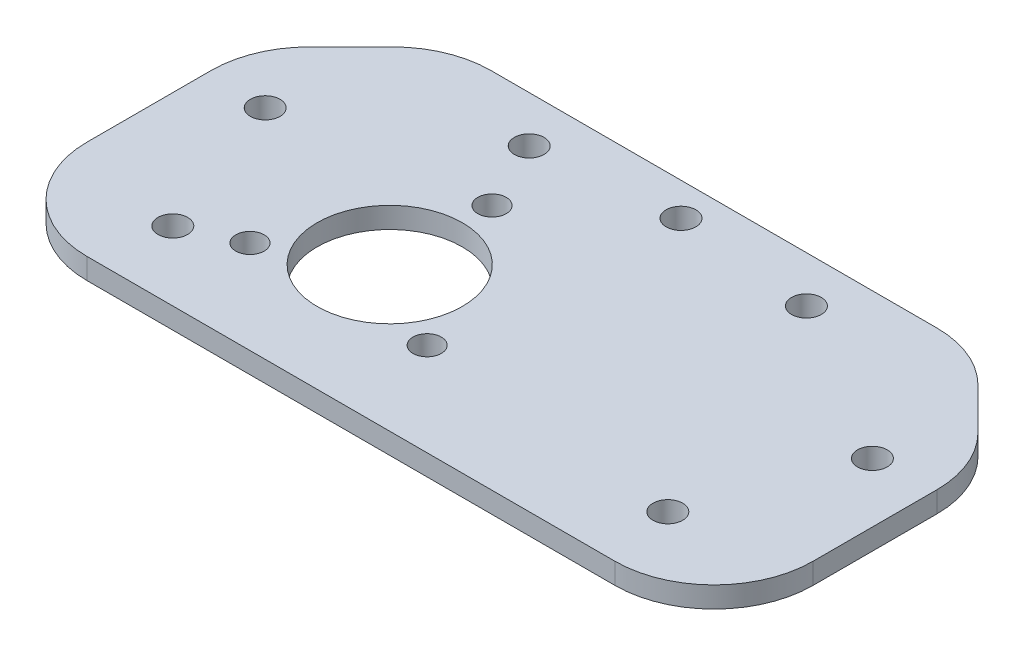
ISO-10303-21;
HEADER;
FILE_DESCRIPTION(('STEP AP214'),'2;1');
FILE_NAME('part.step','',(''),(''),'','','');
FILE_SCHEMA(('AUTOMOTIVE_DESIGN { 1 0 10303 214 1 1 1 1 }'));
ENDSEC;
DATA;
#1=APPLICATION_CONTEXT('core data for automotive mechanical design processes');
#2=APPLICATION_PROTOCOL_DEFINITION('international standard','automotive_design',2000,#1);
#3=PRODUCT_CONTEXT('',#1,'mechanical');
#4=PRODUCT('Part','Part','',(#3));
#5=PRODUCT_RELATED_PRODUCT_CATEGORY('part','',(#4));
#6=PRODUCT_DEFINITION_FORMATION('','',#4);
#7=PRODUCT_DEFINITION_CONTEXT('part definition',#1,'design');
#8=PRODUCT_DEFINITION('design','',#6,#7);
#9=PRODUCT_DEFINITION_SHAPE('','',#8);
#10=(LENGTH_UNIT() NAMED_UNIT(*) SI_UNIT(.MILLI.,.METRE.));
#11=(NAMED_UNIT(*) PLANE_ANGLE_UNIT() SI_UNIT($,.RADIAN.));
#12=(NAMED_UNIT(*) SI_UNIT($,.STERADIAN.) SOLID_ANGLE_UNIT());
#13=UNCERTAINTY_MEASURE_WITH_UNIT(LENGTH_MEASURE(1.E-05),#10,'distance_accuracy_value','');
#14=(GEOMETRIC_REPRESENTATION_CONTEXT(3) GLOBAL_UNCERTAINTY_ASSIGNED_CONTEXT((#13)) GLOBAL_UNIT_ASSIGNED_CONTEXT((#10,
#11,#12)) REPRESENTATION_CONTEXT('',''));
#15=CARTESIAN_POINT('',(0.,0.,0.));
#16=DIRECTION('',(0.,0.,1.));
#17=DIRECTION('',(1.,0.,0.));
#18=AXIS2_PLACEMENT_3D('',#15,#16,#17);
#19=CARTESIAN_POINT('',(0.,-1.5875,0.));
#20=DIRECTION('',(0.,1.,0.));
#21=DIRECTION('',(0.,0.,1.));
#22=AXIS2_PLACEMENT_3D('',#19,#20,#21);
#23=PLANE('',#22);
#24=CARTESIAN_POINT('',(-16.,-1.5875,5.6355287256594));
#25=DIRECTION('',(0.,-1.,0.));
#26=DIRECTION('',(0.,0.,-1.));
#27=AXIS2_PLACEMENT_3D('',#24,#25,#26);
#28=CIRCLE('',#27,11.);
#29=CARTESIAN_POINT('',(-16.,-1.5875,-5.3644712743406));
#30=VERTEX_POINT('',#29);
#31=EDGE_CURVE('E281',#30,#30,#28,.T.);
#32=ORIENTED_EDGE('',*,*,#31,.F.);
#33=EDGE_LOOP('',(#32));
#34=FACE_BOUND('',#33,.T.);
#35=CARTESIAN_POINT('',(-37.5,-1.5875,17.0000000000003));
#36=DIRECTION('',(0.,-1.,0.));
#37=DIRECTION('',(0.,0.,-1.));
#38=AXIS2_PLACEMENT_3D('',#35,#36,#37);
#39=CIRCLE('',#38,2.24999999999999);
#40=CARTESIAN_POINT('',(-37.5,-1.5875,14.7500000000003));
#41=VERTEX_POINT('',#40);
#42=EDGE_CURVE('E277',#41,#41,#39,.T.);
#43=ORIENTED_EDGE('',*,*,#42,.F.);
#44=EDGE_LOOP('',(#43));
#45=FACE_BOUND('',#44,.T.);
#46=CARTESIAN_POINT('',(37.5,-1.5875,17.0000000000003));
#47=DIRECTION('',(0.,-1.,0.));
#48=DIRECTION('',(0.,0.,-1.));
#49=AXIS2_PLACEMENT_3D('',#46,#47,#48);
#50=CIRCLE('',#49,2.24999999999999);
#51=CARTESIAN_POINT('',(37.5,-1.5875,14.7500000000003));
#52=VERTEX_POINT('',#51);
#53=EDGE_CURVE('E271',#52,#52,#50,.T.);
#54=ORIENTED_EDGE('',*,*,#53,.F.);
#55=EDGE_LOOP('',(#54));
#56=FACE_BOUND('',#55,.T.);
#57=CARTESIAN_POINT('',(-46.,-1.5875,-5.50000000000001));
#58=DIRECTION('',(0.,1.,0.));
#59=DIRECTION('',(0.,0.,1.));
#60=AXIS2_PLACEMENT_3D('',#57,#58,#59);
#61=CIRCLE('',#60,2.25);
#62=CARTESIAN_POINT('',(-46.,-1.5875,-3.25000000000001));
#63=VERTEX_POINT('',#62);
#64=EDGE_CURVE('E262',#63,#63,#61,.T.);
#65=ORIENTED_EDGE('',*,*,#64,.T.);
#66=EDGE_LOOP('',(#65));
#67=FACE_BOUND('',#66,.T.);
#68=CARTESIAN_POINT('',(-21.,-1.5875,-20.5));
#69=DIRECTION('',(0.,1.,0.));
#70=DIRECTION('',(0.,0.,1.));
#71=AXIS2_PLACEMENT_3D('',#68,#69,#70);
#72=CIRCLE('',#71,2.25);
#73=CARTESIAN_POINT('',(-21.,-1.5875,-18.25));
#74=VERTEX_POINT('',#73);
#75=EDGE_CURVE('E256',#74,#74,#72,.T.);
#76=ORIENTED_EDGE('',*,*,#75,.T.);
#77=EDGE_LOOP('',(#76));
#78=FACE_BOUND('',#77,.T.);
#79=CARTESIAN_POINT('',(21.,-1.5875,-20.5));
#80=DIRECTION('',(0.,1.,0.));
#81=DIRECTION('',(0.,0.,1.));
#82=AXIS2_PLACEMENT_3D('',#79,#80,#81);
#83=CIRCLE('',#82,2.25);
#84=CARTESIAN_POINT('',(21.,-1.5875,-18.25));
#85=VERTEX_POINT('',#84);
#86=EDGE_CURVE('E250',#85,#85,#83,.T.);
#87=ORIENTED_EDGE('',*,*,#86,.T.);
#88=EDGE_LOOP('',(#87));
#89=FACE_BOUND('',#88,.T.);
#90=CARTESIAN_POINT('',(46.,-1.5875,-5.50000000000001));
#91=DIRECTION('',(0.,1.,0.));
#92=DIRECTION('',(0.,0.,1.));
#93=AXIS2_PLACEMENT_3D('',#90,#91,#92);
#94=CIRCLE('',#93,2.25);
#95=CARTESIAN_POINT('',(46.,-1.5875,-3.25000000000001));
#96=VERTEX_POINT('',#95);
#97=EDGE_CURVE('E244',#96,#96,#94,.T.);
#98=ORIENTED_EDGE('',*,*,#97,.T.);
#99=EDGE_LOOP('',(#98));
#100=FACE_BOUND('',#99,.T.);
#101=CARTESIAN_POINT('',(0.,-1.5875,-22.5));
#102=DIRECTION('',(0.,1.,0.));
#103=DIRECTION('',(0.,0.,1.));
#104=AXIS2_PLACEMENT_3D('',#101,#102,#103);
#105=CIRCLE('',#104,2.25);
#106=CARTESIAN_POINT('',(0.,-1.5875,-20.25));
#107=VERTEX_POINT('',#106);
#108=EDGE_CURVE('E165',#107,#107,#105,.T.);
#109=ORIENTED_EDGE('',*,*,#108,.T.);
#110=EDGE_LOOP('',(#109));
#111=FACE_BOUND('',#110,.T.);
#112=DIRECTION('',(1.,0.,0.));
#113=VECTOR('',#112,1.);
#114=CARTESIAN_POINT('',(55.,-1.5875,27.5));
#115=LINE('',#114,#113);
#116=CARTESIAN_POINT('',(-40.,-1.5875,27.5));
#117=VERTEX_POINT('',#116);
#118=CARTESIAN_POINT('',(40.,-1.5875,27.5));
#119=VERTEX_POINT('',#118);
#120=EDGE_CURVE('E150',#117,#119,#115,.T.);
#121=ORIENTED_EDGE('',*,*,#120,.F.);
#122=CARTESIAN_POINT('',(-40.,-1.5875,12.5));
#123=DIRECTION('',(0.,1.,0.));
#124=DIRECTION('',(0.,0.,1.));
#125=AXIS2_PLACEMENT_3D('',#122,#123,#124);
#126=CIRCLE('',#125,15.);
#127=CARTESIAN_POINT('',(-55.,-1.5875,12.5));
#128=VERTEX_POINT('',#127);
#129=EDGE_CURVE('E133',#117,#128,#126,.F.);
#130=ORIENTED_EDGE('',*,*,#129,.T.);
#131=DIRECTION('',(0.,0.,1.));
#132=VECTOR('',#131,1.);
#133=CARTESIAN_POINT('',(-55.,-1.5875,27.5));
#134=LINE('',#133,#132);
#135=CARTESIAN_POINT('',(-55.,-1.5875,-6.28679656440358));
#136=VERTEX_POINT('',#135);
#137=EDGE_CURVE('E160',#136,#128,#134,.T.);
#138=ORIENTED_EDGE('',*,*,#137,.F.);
#139=CARTESIAN_POINT('',(-40.,-1.5875,-6.28679656440358));
#140=DIRECTION('',(0.,1.,0.));
#141=DIRECTION('',(0.,0.,1.));
#142=AXIS2_PLACEMENT_3D('',#139,#140,#141);
#143=CIRCLE('',#142,15.);
#144=CARTESIAN_POINT('',(-50.6066017177982,-1.5875,-16.8933982822018));
#145=VERTEX_POINT('',#144);
#146=EDGE_CURVE('E144',#136,#145,#143,.F.);
#147=ORIENTED_EDGE('',*,*,#146,.T.);
#148=DIRECTION('',(-0.707106781186549,0.,0.707106781186546));
#149=VECTOR('',#148,1.);
#150=CARTESIAN_POINT('',(-55.,-1.5875,-12.5));
#151=LINE('',#150,#149);
#152=CARTESIAN_POINT('',(-44.3933982822018,-1.5875,-23.1066017177982));
#153=VERTEX_POINT('',#152);
#154=EDGE_CURVE('E175',#145,#153,#151,.F.);
#155=ORIENTED_EDGE('',*,*,#154,.T.);
#156=CARTESIAN_POINT('',(-33.7867965644036,-1.5875,-12.5));
#157=DIRECTION('',(0.,1.,0.));
#158=DIRECTION('',(0.,0.,1.));
#159=AXIS2_PLACEMENT_3D('',#156,#157,#158);
#160=CIRCLE('',#159,15.);
#161=CARTESIAN_POINT('',(-33.7867965644036,-1.5875,-27.5));
#162=VERTEX_POINT('',#161);
#163=EDGE_CURVE('E190',#153,#162,#160,.F.);
#164=ORIENTED_EDGE('',*,*,#163,.T.);
#165=DIRECTION('',(-1.,0.,0.));
#166=VECTOR('',#165,1.);
#167=CARTESIAN_POINT('',(55.,-1.5875,-27.5));
#168=LINE('',#167,#166);
#169=CARTESIAN_POINT('',(33.7867965644036,-1.5875,-27.5));
#170=VERTEX_POINT('',#169);
#171=EDGE_CURVE('E163',#170,#162,#168,.T.);
#172=ORIENTED_EDGE('',*,*,#171,.F.);
#173=CARTESIAN_POINT('',(33.7867965644036,-1.5875,-12.5));
#174=DIRECTION('',(0.,1.,0.));
#175=DIRECTION('',(0.,0.,1.));
#176=AXIS2_PLACEMENT_3D('',#173,#174,#175);
#177=CIRCLE('',#176,15.);
#178=CARTESIAN_POINT('',(44.3933982822018,-1.5875,-23.1066017177982));
#179=VERTEX_POINT('',#178);
#180=EDGE_CURVE('E188',#170,#179,#177,.F.);
#181=ORIENTED_EDGE('',*,*,#180,.T.);
#182=DIRECTION('',(-0.707106781186546,0.,-0.707106781186549));
#183=VECTOR('',#182,1.);
#184=CARTESIAN_POINT('',(40.,-1.5875,-27.5));
#185=LINE('',#184,#183);
#186=CARTESIAN_POINT('',(50.6066017177982,-1.5875,-16.8933982822017));
#187=VERTEX_POINT('',#186);
#188=EDGE_CURVE('E172',#179,#187,#185,.F.);
#189=ORIENTED_EDGE('',*,*,#188,.T.);
#190=CARTESIAN_POINT('',(40.,-1.5875,-6.28679656440354));
#191=DIRECTION('',(0.,1.,0.));
#192=DIRECTION('',(0.,0.,1.));
#193=AXIS2_PLACEMENT_3D('',#190,#191,#192);
#194=CIRCLE('',#193,15.);
#195=CARTESIAN_POINT('',(55.,-1.5875,-6.28679656440354));
#196=VERTEX_POINT('',#195);
#197=EDGE_CURVE('E186',#187,#196,#194,.F.);
#198=ORIENTED_EDGE('',*,*,#197,.T.);
#199=DIRECTION('',(0.,0.,-1.));
#200=VECTOR('',#199,1.);
#201=CARTESIAN_POINT('',(55.,-1.5875,27.5));
#202=LINE('',#201,#200);
#203=CARTESIAN_POINT('',(55.,-1.5875,12.5));
#204=VERTEX_POINT('',#203);
#205=EDGE_CURVE('E159',#204,#196,#202,.T.);
#206=ORIENTED_EDGE('',*,*,#205,.F.);
#207=CARTESIAN_POINT('',(40.,-1.5875,12.5));
#208=DIRECTION('',(0.,1.,0.));
#209=DIRECTION('',(0.,0.,1.));
#210=AXIS2_PLACEMENT_3D('',#207,#208,#209);
#211=CIRCLE('',#210,15.);
#212=EDGE_CURVE('E154',#204,#119,#211,.F.);
#213=ORIENTED_EDGE('',*,*,#212,.T.);
#214=EDGE_LOOP('',(#121,#130,#138,#147,#155,#164,#172,#181,#189,#198,#206,#213));
#215=FACE_BOUND('',#214,.T.);
#216=CARTESIAN_POINT('',(-29.4233937586589,-1.5875,13.3855287256599));
#217=DIRECTION('',(0.,-1.,0.));
#218=DIRECTION('',(0.,0.,-1.));
#219=AXIS2_PLACEMENT_3D('',#216,#217,#218);
#220=CIRCLE('',#219,2.15);
#221=CARTESIAN_POINT('',(-29.4233937586589,-1.5875,11.2355287256599));
#222=VERTEX_POINT('',#221);
#223=EDGE_CURVE('E289',#222,#222,#220,.T.);
#224=ORIENTED_EDGE('',*,*,#223,.F.);
#225=EDGE_LOOP('',(#224));
#226=FACE_BOUND('',#225,.T.);
#227=CARTESIAN_POINT('',(-2.57660624134124,-1.5875,13.3855287256599));
#228=DIRECTION('',(0.,-1.,0.));
#229=DIRECTION('',(0.,0.,-1.));
#230=AXIS2_PLACEMENT_3D('',#227,#228,#229);
#231=CIRCLE('',#230,2.15);
#232=CARTESIAN_POINT('',(-2.57660624134124,-1.5875,11.2355287256599));
#233=VERTEX_POINT('',#232);
#234=EDGE_CURVE('E295',#233,#233,#231,.T.);
#235=ORIENTED_EDGE('',*,*,#234,.F.);
#236=EDGE_LOOP('',(#235));
#237=FACE_BOUND('',#236,.T.);
#238=CARTESIAN_POINT('',(-16.0000000000001,-1.5875,-9.8644712743401));
#239=DIRECTION('',(0.,-1.,0.));
#240=DIRECTION('',(0.,0.,-1.));
#241=AXIS2_PLACEMENT_3D('',#238,#239,#240);
#242=CIRCLE('',#241,2.15);
#243=CARTESIAN_POINT('',(-16.0000000000001,-1.5875,-12.0144712743401));
#244=VERTEX_POINT('',#243);
#245=EDGE_CURVE('E301',#244,#244,#242,.T.);
#246=ORIENTED_EDGE('',*,*,#245,.F.);
#247=EDGE_LOOP('',(#246));
#248=FACE_BOUND('',#247,.T.);
#249=ADVANCED_FACE('F43',(#34,#45,#56,#67,#78,#89,#100,#111,#215,#226,#237,#248),#23,.F.);
#250=CARTESIAN_POINT('',(-55.,1.5875,27.5));
#251=DIRECTION('',(1.,0.,0.));
#252=DIRECTION('',(0.,0.,-1.));
#253=AXIS2_PLACEMENT_3D('',#250,#251,#252);
#254=PLANE('',#253);
#255=ORIENTED_EDGE('',*,*,#137,.T.);
#256=DIRECTION('',(0.,-1.,0.));
#257=VECTOR('',#256,1.);
#258=CARTESIAN_POINT('',(-55.,1.5875,12.5));
#259=LINE('',#258,#257);
#260=CARTESIAN_POINT('',(-55.,1.5875,12.5));
#261=VERTEX_POINT('',#260);
#262=EDGE_CURVE('E138',#128,#261,#259,.F.);
#263=ORIENTED_EDGE('',*,*,#262,.T.);
#264=DIRECTION('',(0.,0.,1.));
#265=VECTOR('',#264,1.);
#266=CARTESIAN_POINT('',(-55.,1.5875,27.5));
#267=LINE('',#266,#265);
#268=CARTESIAN_POINT('',(-55.,1.5875,-6.28679656440358));
#269=VERTEX_POINT('',#268);
#270=EDGE_CURVE('E171',#269,#261,#267,.T.);
#271=ORIENTED_EDGE('',*,*,#270,.F.);
#272=DIRECTION('',(0.,1.,0.));
#273=VECTOR('',#272,1.);
#274=CARTESIAN_POINT('',(-55.,-1.5875,-6.28679656440358));
#275=LINE('',#274,#273);
#276=EDGE_CURVE('E143',#269,#136,#275,.F.);
#277=ORIENTED_EDGE('',*,*,#276,.T.);
#278=EDGE_LOOP('',(#255,#263,#271,#277));
#279=FACE_BOUND('',#278,.T.);
#280=ADVANCED_FACE('F309',(#279),#254,.F.);
#281=CARTESIAN_POINT('',(55.,1.5875,27.5));
#282=DIRECTION('',(0.,0.,-1.));
#283=DIRECTION('',(-1.,0.,0.));
#284=AXIS2_PLACEMENT_3D('',#281,#282,#283);
#285=PLANE('',#284);
#286=DIRECTION('',(1.,0.,0.));
#287=VECTOR('',#286,1.);
#288=CARTESIAN_POINT('',(55.,1.5875,27.5));
#289=LINE('',#288,#287);
#290=CARTESIAN_POINT('',(-40.,1.5875,27.5));
#291=VERTEX_POINT('',#290);
#292=CARTESIAN_POINT('',(40.,1.5875,27.5));
#293=VERTEX_POINT('',#292);
#294=EDGE_CURVE('E153',#291,#293,#289,.T.);
#295=ORIENTED_EDGE('',*,*,#294,.F.);
#296=DIRECTION('',(0.,-1.,0.));
#297=VECTOR('',#296,1.);
#298=CARTESIAN_POINT('',(-40.,1.5875,27.5));
#299=LINE('',#298,#297);
#300=EDGE_CURVE('E137',#291,#117,#299,.T.);
#301=ORIENTED_EDGE('',*,*,#300,.T.);
#302=ORIENTED_EDGE('',*,*,#120,.T.);
#303=DIRECTION('',(0.,-1.,0.));
#304=VECTOR('',#303,1.);
#305=CARTESIAN_POINT('',(40.,1.5875,27.5));
#306=LINE('',#305,#304);
#307=EDGE_CURVE('E155',#119,#293,#306,.F.);
#308=ORIENTED_EDGE('',*,*,#307,.T.);
#309=EDGE_LOOP('',(#295,#301,#302,#308));
#310=FACE_BOUND('',#309,.T.);
#311=ADVANCED_FACE('F149',(#310),#285,.F.);
#312=CARTESIAN_POINT('',(55.,1.5875,27.5));
#313=DIRECTION('',(-1.,0.,0.));
#314=DIRECTION('',(0.,0.,1.));
#315=AXIS2_PLACEMENT_3D('',#312,#313,#314);
#316=PLANE('',#315);
#317=ORIENTED_EDGE('',*,*,#205,.T.);
#318=DIRECTION('',(0.,-1.,0.));
#319=VECTOR('',#318,1.);
#320=CARTESIAN_POINT('',(55.,1.5875,-6.28679656440354));
#321=LINE('',#320,#319);
#322=CARTESIAN_POINT('',(55.,1.5875,-6.28679656440354));
#323=VERTEX_POINT('',#322);
#324=EDGE_CURVE('E11',#196,#323,#321,.F.);
#325=ORIENTED_EDGE('',*,*,#324,.T.);
#326=DIRECTION('',(0.,0.,-1.));
#327=VECTOR('',#326,1.);
#328=CARTESIAN_POINT('',(55.,1.5875,27.5));
#329=LINE('',#328,#327);
#330=CARTESIAN_POINT('',(55.,1.5875,12.5));
#331=VERTEX_POINT('',#330);
#332=EDGE_CURVE('E225',#331,#323,#329,.T.);
#333=ORIENTED_EDGE('',*,*,#332,.F.);
#334=DIRECTION('',(0.,-1.,0.));
#335=VECTOR('',#334,1.);
#336=CARTESIAN_POINT('',(55.,1.5875,12.5));
#337=LINE('',#336,#335);
#338=EDGE_CURVE('E51',#331,#204,#337,.T.);
#339=ORIENTED_EDGE('',*,*,#338,.T.);
#340=EDGE_LOOP('',(#317,#325,#333,#339));
#341=FACE_BOUND('',#340,.T.);
#342=ADVANCED_FACE('F223',(#341),#316,.F.);
#343=CARTESIAN_POINT('',(55.,1.5875,-27.5));
#344=DIRECTION('',(0.,0.,1.));
#345=DIRECTION('',(1.,0.,0.));
#346=AXIS2_PLACEMENT_3D('',#343,#344,#345);
#347=PLANE('',#346);
#348=ORIENTED_EDGE('',*,*,#171,.T.);
#349=DIRECTION('',(0.,-1.,0.));
#350=VECTOR('',#349,1.);
#351=CARTESIAN_POINT('',(-33.7867965644036,1.5875,-27.5));
#352=LINE('',#351,#350);
#353=CARTESIAN_POINT('',(-33.7867965644036,1.5875,-27.5));
#354=VERTEX_POINT('',#353);
#355=EDGE_CURVE('E214',#162,#354,#352,.F.);
#356=ORIENTED_EDGE('',*,*,#355,.T.);
#357=DIRECTION('',(-1.,0.,0.));
#358=VECTOR('',#357,1.);
#359=CARTESIAN_POINT('',(55.,1.5875,-27.5));
#360=LINE('',#359,#358);
#361=CARTESIAN_POINT('',(33.7867965644036,1.5875,-27.5));
#362=VERTEX_POINT('',#361);
#363=EDGE_CURVE('E176',#362,#354,#360,.T.);
#364=ORIENTED_EDGE('',*,*,#363,.F.);
#365=DIRECTION('',(0.,1.,0.));
#366=VECTOR('',#365,1.);
#367=CARTESIAN_POINT('',(33.7867965644036,-1.5875,-27.5));
#368=LINE('',#367,#366);
#369=EDGE_CURVE('E211',#362,#170,#368,.F.);
#370=ORIENTED_EDGE('',*,*,#369,.T.);
#371=EDGE_LOOP('',(#348,#356,#364,#370));
#372=FACE_BOUND('',#371,.T.);
#373=ADVANCED_FACE('F324',(#372),#347,.F.);
#374=CARTESIAN_POINT('',(0.,1.5875,0.));
#375=DIRECTION('',(0.,1.,0.));
#376=DIRECTION('',(0.,0.,1.));
#377=AXIS2_PLACEMENT_3D('',#374,#375,#376);
#378=PLANE('',#377);
#379=CARTESIAN_POINT('',(-16.0000000000001,1.5875,-9.8644712743401));
#380=DIRECTION('',(0.,1.,0.));
#381=DIRECTION('',(0.,0.,1.));
#382=AXIS2_PLACEMENT_3D('',#379,#380,#381);
#383=CIRCLE('',#382,2.15);
#384=CARTESIAN_POINT('',(-16.0000000000001,1.5875,-7.7144712743401));
#385=VERTEX_POINT('',#384);
#386=EDGE_CURVE('E298',#385,#385,#383,.T.);
#387=ORIENTED_EDGE('',*,*,#386,.F.);
#388=EDGE_LOOP('',(#387));
#389=FACE_BOUND('',#388,.T.);
#390=CARTESIAN_POINT('',(-2.57660624134124,1.5875,13.3855287256599));
#391=DIRECTION('',(0.,1.,0.));
#392=DIRECTION('',(0.,0.,1.));
#393=AXIS2_PLACEMENT_3D('',#390,#391,#392);
#394=CIRCLE('',#393,2.15);
#395=CARTESIAN_POINT('',(-2.57660624134124,1.5875,15.5355287256599));
#396=VERTEX_POINT('',#395);
#397=EDGE_CURVE('E292',#396,#396,#394,.T.);
#398=ORIENTED_EDGE('',*,*,#397,.F.);
#399=EDGE_LOOP('',(#398));
#400=FACE_BOUND('',#399,.T.);
#401=CARTESIAN_POINT('',(-29.4233937586589,1.5875,13.3855287256599));
#402=DIRECTION('',(0.,1.,0.));
#403=DIRECTION('',(0.,0.,1.));
#404=AXIS2_PLACEMENT_3D('',#401,#402,#403);
#405=CIRCLE('',#404,2.15);
#406=CARTESIAN_POINT('',(-29.4233937586589,1.5875,15.5355287256599));
#407=VERTEX_POINT('',#406);
#408=EDGE_CURVE('E284',#407,#407,#405,.T.);
#409=ORIENTED_EDGE('',*,*,#408,.F.);
#410=EDGE_LOOP('',(#409));
#411=FACE_BOUND('',#410,.T.);
#412=CARTESIAN_POINT('',(-16.,1.5875,5.6355287256594));
#413=DIRECTION('',(0.,-1.,0.));
#414=DIRECTION('',(0.,0.,-1.));
#415=AXIS2_PLACEMENT_3D('',#412,#413,#414);
#416=CIRCLE('',#415,11.);
#417=CARTESIAN_POINT('',(-16.,1.5875,-5.3644712743406));
#418=VERTEX_POINT('',#417);
#419=EDGE_CURVE('E280',#418,#418,#416,.T.);
#420=ORIENTED_EDGE('',*,*,#419,.T.);
#421=EDGE_LOOP('',(#420));
#422=FACE_BOUND('',#421,.T.);
#423=CARTESIAN_POINT('',(-37.5,1.5875,17.0000000000003));
#424=DIRECTION('',(0.,-1.,0.));
#425=DIRECTION('',(0.,0.,-1.));
#426=AXIS2_PLACEMENT_3D('',#423,#424,#425);
#427=CIRCLE('',#426,2.25);
#428=CARTESIAN_POINT('',(-37.5,1.5875,14.7500000000003));
#429=VERTEX_POINT('',#428);
#430=EDGE_CURVE('E274',#429,#429,#427,.T.);
#431=ORIENTED_EDGE('',*,*,#430,.T.);
#432=EDGE_LOOP('',(#431));
#433=FACE_BOUND('',#432,.T.);
#434=CARTESIAN_POINT('',(37.5,1.5875,17.0000000000003));
#435=DIRECTION('',(0.,-1.,0.));
#436=DIRECTION('',(0.,0.,-1.));
#437=AXIS2_PLACEMENT_3D('',#434,#435,#436);
#438=CIRCLE('',#437,2.25);
#439=CARTESIAN_POINT('',(37.5,1.5875,14.7500000000003));
#440=VERTEX_POINT('',#439);
#441=EDGE_CURVE('E268',#440,#440,#438,.T.);
#442=ORIENTED_EDGE('',*,*,#441,.T.);
#443=EDGE_LOOP('',(#442));
#444=FACE_BOUND('',#443,.T.);
#445=CARTESIAN_POINT('',(-46.,1.5875,-5.50000000000001));
#446=DIRECTION('',(0.,1.,0.));
#447=DIRECTION('',(0.,0.,1.));
#448=AXIS2_PLACEMENT_3D('',#445,#446,#447);
#449=CIRCLE('',#448,2.24999999999999);
#450=CARTESIAN_POINT('',(-46.,1.5875,-3.25000000000002));
#451=VERTEX_POINT('',#450);
#452=EDGE_CURVE('E265',#451,#451,#449,.T.);
#453=ORIENTED_EDGE('',*,*,#452,.F.);
#454=EDGE_LOOP('',(#453));
#455=FACE_BOUND('',#454,.T.);
#456=CARTESIAN_POINT('',(-21.,1.5875,-20.5));
#457=DIRECTION('',(0.,1.,0.));
#458=DIRECTION('',(0.,0.,1.));
#459=AXIS2_PLACEMENT_3D('',#456,#457,#458);
#460=CIRCLE('',#459,2.24999999999999);
#461=CARTESIAN_POINT('',(-21.,1.5875,-18.25));
#462=VERTEX_POINT('',#461);
#463=EDGE_CURVE('E259',#462,#462,#460,.T.);
#464=ORIENTED_EDGE('',*,*,#463,.F.);
#465=EDGE_LOOP('',(#464));
#466=FACE_BOUND('',#465,.T.);
#467=CARTESIAN_POINT('',(21.,1.5875,-20.5));
#468=DIRECTION('',(0.,1.,0.));
#469=DIRECTION('',(0.,0.,1.));
#470=AXIS2_PLACEMENT_3D('',#467,#468,#469);
#471=CIRCLE('',#470,2.24999999999999);
#472=CARTESIAN_POINT('',(21.,1.5875,-18.25));
#473=VERTEX_POINT('',#472);
#474=EDGE_CURVE('E253',#473,#473,#471,.T.);
#475=ORIENTED_EDGE('',*,*,#474,.F.);
#476=EDGE_LOOP('',(#475));
#477=FACE_BOUND('',#476,.T.);
#478=CARTESIAN_POINT('',(46.,1.5875,-5.50000000000001));
#479=DIRECTION('',(0.,1.,0.));
#480=DIRECTION('',(0.,0.,1.));
#481=AXIS2_PLACEMENT_3D('',#478,#479,#480);
#482=CIRCLE('',#481,2.24999999999999);
#483=CARTESIAN_POINT('',(46.,1.5875,-3.25000000000002));
#484=VERTEX_POINT('',#483);
#485=EDGE_CURVE('E247',#484,#484,#482,.T.);
#486=ORIENTED_EDGE('',*,*,#485,.F.);
#487=EDGE_LOOP('',(#486));
#488=FACE_BOUND('',#487,.T.);
#489=CARTESIAN_POINT('',(0.,1.5875,-22.5));
#490=DIRECTION('',(0.,1.,0.));
#491=DIRECTION('',(0.,0.,1.));
#492=AXIS2_PLACEMENT_3D('',#489,#490,#491);
#493=CIRCLE('',#492,2.24999999999999);
#494=CARTESIAN_POINT('',(0.,1.5875,-20.25));
#495=VERTEX_POINT('',#494);
#496=EDGE_CURVE('E241',#495,#495,#493,.T.);
#497=ORIENTED_EDGE('',*,*,#496,.F.);
#498=EDGE_LOOP('',(#497));
#499=FACE_BOUND('',#498,.T.);
#500=ORIENTED_EDGE('',*,*,#270,.T.);
#501=CARTESIAN_POINT('',(-40.,1.5875,12.5));
#502=DIRECTION('',(0.,1.,0.));
#503=DIRECTION('',(0.,0.,1.));
#504=AXIS2_PLACEMENT_3D('',#501,#502,#503);
#505=CIRCLE('',#504,15.);
#506=EDGE_CURVE('E205',#261,#291,#505,.T.);
#507=ORIENTED_EDGE('',*,*,#506,.T.);
#508=ORIENTED_EDGE('',*,*,#294,.T.);
#509=CARTESIAN_POINT('',(40.,1.5875,12.5));
#510=DIRECTION('',(0.,1.,0.));
#511=DIRECTION('',(0.,0.,1.));
#512=AXIS2_PLACEMENT_3D('',#509,#510,#511);
#513=CIRCLE('',#512,15.);
#514=EDGE_CURVE('E196',#293,#331,#513,.T.);
#515=ORIENTED_EDGE('',*,*,#514,.T.);
#516=ORIENTED_EDGE('',*,*,#332,.T.);
#517=CARTESIAN_POINT('',(40.,1.5875,-6.28679656440354));
#518=DIRECTION('',(0.,1.,0.));
#519=DIRECTION('',(0.,0.,1.));
#520=AXIS2_PLACEMENT_3D('',#517,#518,#519);
#521=CIRCLE('',#520,15.);
#522=CARTESIAN_POINT('',(50.6066017177982,1.5875,-16.8933982822017));
#523=VERTEX_POINT('',#522);
#524=EDGE_CURVE('E65',#323,#523,#521,.T.);
#525=ORIENTED_EDGE('',*,*,#524,.T.);
#526=DIRECTION('',(0.707106781186546,0.,0.707106781186549));
#527=VECTOR('',#526,1.);
#528=CARTESIAN_POINT('',(33.7500000000001,1.5875,-33.7499999999999));
#529=LINE('',#528,#527);
#530=CARTESIAN_POINT('',(44.3933982822018,1.5875,-23.1066017177982));
#531=VERTEX_POINT('',#530);
#532=EDGE_CURVE('E179',#523,#531,#529,.F.);
#533=ORIENTED_EDGE('',*,*,#532,.T.);
#534=CARTESIAN_POINT('',(33.7867965644036,1.5875,-12.5));
#535=DIRECTION('',(0.,1.,0.));
#536=DIRECTION('',(0.,0.,1.));
#537=AXIS2_PLACEMENT_3D('',#534,#535,#536);
#538=CIRCLE('',#537,15.);
#539=EDGE_CURVE('E199',#531,#362,#538,.T.);
#540=ORIENTED_EDGE('',*,*,#539,.T.);
#541=ORIENTED_EDGE('',*,*,#363,.T.);
#542=CARTESIAN_POINT('',(-33.7867965644036,1.5875,-12.5));
#543=DIRECTION('',(0.,1.,0.));
#544=DIRECTION('',(0.,0.,1.));
#545=AXIS2_PLACEMENT_3D('',#542,#543,#544);
#546=CIRCLE('',#545,15.);
#547=CARTESIAN_POINT('',(-44.3933982822018,1.5875,-23.1066017177982));
#548=VERTEX_POINT('',#547);
#549=EDGE_CURVE('E201',#354,#548,#546,.T.);
#550=ORIENTED_EDGE('',*,*,#549,.T.);
#551=DIRECTION('',(0.707106781186549,0.,-0.707106781186546));
#552=VECTOR('',#551,1.);
#553=CARTESIAN_POINT('',(-33.7499999999999,1.5875,-33.75));
#554=LINE('',#553,#552);
#555=CARTESIAN_POINT('',(-50.6066017177982,1.5875,-16.8933982822018));
#556=VERTEX_POINT('',#555);
#557=EDGE_CURVE('E181',#548,#556,#554,.F.);
#558=ORIENTED_EDGE('',*,*,#557,.T.);
#559=CARTESIAN_POINT('',(-40.,1.5875,-6.28679656440358));
#560=DIRECTION('',(0.,1.,0.));
#561=DIRECTION('',(0.,0.,1.));
#562=AXIS2_PLACEMENT_3D('',#559,#560,#561);
#563=CIRCLE('',#562,15.);
#564=EDGE_CURVE('E203',#556,#269,#563,.T.);
#565=ORIENTED_EDGE('',*,*,#564,.T.);
#566=EDGE_LOOP('',(#500,#507,#508,#515,#516,#525,#533,#540,#541,#550,#558,#565));
#567=FACE_BOUND('',#566,.T.);
#568=ADVANCED_FACE('F233',(#389,#400,#411,#422,#433,#444,#455,#466,#477,#488,#499,#567),#378,.T.);
#569=CARTESIAN_POINT('',(0.,1.5875,-22.5));
#570=DIRECTION('',(0.,1.,0.));
#571=DIRECTION('',(0.,0.,1.));
#572=AXIS2_PLACEMENT_3D('',#569,#570,#571);
#573=CYLINDRICAL_SURFACE('',#572,2.24999999999999);
#574=ORIENTED_EDGE('',*,*,#108,.F.);
#575=EDGE_LOOP('',(#574));
#576=FACE_BOUND('',#575,.T.);
#577=ORIENTED_EDGE('',*,*,#496,.T.);
#578=EDGE_LOOP('',(#577));
#579=FACE_BOUND('',#578,.T.);
#580=ADVANCED_FACE('F413',(#576,#579),#573,.F.);
#581=CARTESIAN_POINT('',(46.,1.5875,-5.50000000000001));
#582=DIRECTION('',(0.,1.,0.));
#583=DIRECTION('',(0.,0.,1.));
#584=AXIS2_PLACEMENT_3D('',#581,#582,#583);
#585=CYLINDRICAL_SURFACE('',#584,2.25);
#586=ORIENTED_EDGE('',*,*,#97,.F.);
#587=EDGE_LOOP('',(#586));
#588=FACE_BOUND('',#587,.T.);
#589=ORIENTED_EDGE('',*,*,#485,.T.);
#590=EDGE_LOOP('',(#589));
#591=FACE_BOUND('',#590,.T.);
#592=ADVANCED_FACE('F410',(#588,#591),#585,.F.);
#593=CARTESIAN_POINT('',(21.,1.5875,-20.5));
#594=DIRECTION('',(0.,1.,0.));
#595=DIRECTION('',(0.,0.,1.));
#596=AXIS2_PLACEMENT_3D('',#593,#594,#595);
#597=CYLINDRICAL_SURFACE('',#596,2.24999999999999);
#598=ORIENTED_EDGE('',*,*,#86,.F.);
#599=EDGE_LOOP('',(#598));
#600=FACE_BOUND('',#599,.T.);
#601=ORIENTED_EDGE('',*,*,#474,.T.);
#602=EDGE_LOOP('',(#601));
#603=FACE_BOUND('',#602,.T.);
#604=ADVANCED_FACE('F406',(#600,#603),#597,.F.);
#605=CARTESIAN_POINT('',(-21.,1.5875,-20.5));
#606=DIRECTION('',(0.,1.,0.));
#607=DIRECTION('',(0.,0.,1.));
#608=AXIS2_PLACEMENT_3D('',#605,#606,#607);
#609=CYLINDRICAL_SURFACE('',#608,2.24999999999999);
#610=ORIENTED_EDGE('',*,*,#75,.F.);
#611=EDGE_LOOP('',(#610));
#612=FACE_BOUND('',#611,.T.);
#613=ORIENTED_EDGE('',*,*,#463,.T.);
#614=EDGE_LOOP('',(#613));
#615=FACE_BOUND('',#614,.T.);
#616=ADVANCED_FACE('F402',(#612,#615),#609,.F.);
#617=CARTESIAN_POINT('',(-46.,1.5875,-5.50000000000001));
#618=DIRECTION('',(0.,1.,0.));
#619=DIRECTION('',(0.,0.,1.));
#620=AXIS2_PLACEMENT_3D('',#617,#618,#619);
#621=CYLINDRICAL_SURFACE('',#620,2.25);
#622=ORIENTED_EDGE('',*,*,#64,.F.);
#623=EDGE_LOOP('',(#622));
#624=FACE_BOUND('',#623,.T.);
#625=ORIENTED_EDGE('',*,*,#452,.T.);
#626=EDGE_LOOP('',(#625));
#627=FACE_BOUND('',#626,.T.);
#628=ADVANCED_FACE('F398',(#624,#627),#621,.F.);
#629=CARTESIAN_POINT('',(37.5,-1.5875,17.0000000000003));
#630=DIRECTION('',(0.,-1.,0.));
#631=DIRECTION('',(0.,0.,-1.));
#632=AXIS2_PLACEMENT_3D('',#629,#630,#631);
#633=CYLINDRICAL_SURFACE('',#632,2.25);
#634=ORIENTED_EDGE('',*,*,#441,.F.);
#635=EDGE_LOOP('',(#634));
#636=FACE_BOUND('',#635,.T.);
#637=ORIENTED_EDGE('',*,*,#53,.T.);
#638=EDGE_LOOP('',(#637));
#639=FACE_BOUND('',#638,.T.);
#640=ADVANCED_FACE('F394',(#636,#639),#633,.F.);
#641=CARTESIAN_POINT('',(-37.5,-1.5875,17.0000000000003));
#642=DIRECTION('',(0.,-1.,0.));
#643=DIRECTION('',(0.,0.,-1.));
#644=AXIS2_PLACEMENT_3D('',#641,#642,#643);
#645=CYLINDRICAL_SURFACE('',#644,2.25);
#646=ORIENTED_EDGE('',*,*,#430,.F.);
#647=EDGE_LOOP('',(#646));
#648=FACE_BOUND('',#647,.T.);
#649=ORIENTED_EDGE('',*,*,#42,.T.);
#650=EDGE_LOOP('',(#649));
#651=FACE_BOUND('',#650,.T.);
#652=ADVANCED_FACE('F340',(#648,#651),#645,.F.);
#653=CARTESIAN_POINT('',(-55.,1.5875,-12.5));
#654=DIRECTION('',(0.707106781186546,0.,0.707106781186549));
#655=DIRECTION('',(0.,-1.,0.));
#656=AXIS2_PLACEMENT_3D('',#653,#654,#655);
#657=PLANE('',#656);
#658=ORIENTED_EDGE('',*,*,#154,.F.);
#659=DIRECTION('',(0.,-1.,0.));
#660=VECTOR('',#659,1.);
#661=CARTESIAN_POINT('',(-50.6066017177982,1.5875,-16.8933982822018));
#662=LINE('',#661,#660);
#663=EDGE_CURVE('E209',#145,#556,#662,.F.);
#664=ORIENTED_EDGE('',*,*,#663,.T.);
#665=ORIENTED_EDGE('',*,*,#557,.F.);
#666=DIRECTION('',(0.,1.,0.));
#667=VECTOR('',#666,1.);
#668=CARTESIAN_POINT('',(-44.3933982822018,-1.5875,-23.1066017177982));
#669=LINE('',#668,#667);
#670=EDGE_CURVE('E207',#548,#153,#669,.F.);
#671=ORIENTED_EDGE('',*,*,#670,.T.);
#672=EDGE_LOOP('',(#658,#664,#665,#671));
#673=FACE_BOUND('',#672,.T.);
#674=ADVANCED_FACE('F333',(#673),#657,.F.);
#675=CARTESIAN_POINT('',(40.,1.5875,-27.5));
#676=DIRECTION('',(-0.707106781186549,0.,0.707106781186546));
#677=DIRECTION('',(0.,-1.,0.));
#678=AXIS2_PLACEMENT_3D('',#675,#676,#677);
#679=PLANE('',#678);
#680=ORIENTED_EDGE('',*,*,#188,.F.);
#681=DIRECTION('',(0.,-1.,0.));
#682=VECTOR('',#681,1.);
#683=CARTESIAN_POINT('',(44.3933982822018,1.5875,-23.1066017177982));
#684=LINE('',#683,#682);
#685=EDGE_CURVE('E58',#179,#531,#684,.F.);
#686=ORIENTED_EDGE('',*,*,#685,.T.);
#687=ORIENTED_EDGE('',*,*,#532,.F.);
#688=DIRECTION('',(0.,1.,0.));
#689=VECTOR('',#688,1.);
#690=CARTESIAN_POINT('',(50.6066017177982,-1.5875,-16.8933982822017));
#691=LINE('',#690,#689);
#692=EDGE_CURVE('E217',#523,#187,#691,.F.);
#693=ORIENTED_EDGE('',*,*,#692,.T.);
#694=EDGE_LOOP('',(#680,#686,#687,#693));
#695=FACE_BOUND('',#694,.T.);
#696=ADVANCED_FACE('F339',(#695),#679,.F.);
#697=CARTESIAN_POINT('',(-40.,1.5875,12.5));
#698=DIRECTION('',(0.,-1.,0.));
#699=DIRECTION('',(0.,0.,-1.));
#700=AXIS2_PLACEMENT_3D('',#697,#698,#699);
#701=CYLINDRICAL_SURFACE('',#700,15.);
#702=ORIENTED_EDGE('',*,*,#506,.F.);
#703=ORIENTED_EDGE('',*,*,#262,.F.);
#704=ORIENTED_EDGE('',*,*,#129,.F.);
#705=ORIENTED_EDGE('',*,*,#300,.F.);
#706=EDGE_LOOP('',(#702,#703,#704,#705));
#707=FACE_BOUND('',#706,.T.);
#708=ADVANCED_FACE('F136',(#707),#701,.T.);
#709=CARTESIAN_POINT('',(-40.,1.5875,-6.28679656440358));
#710=DIRECTION('',(0.,-1.,0.));
#711=DIRECTION('',(0.,0.,-1.));
#712=AXIS2_PLACEMENT_3D('',#709,#710,#711);
#713=CYLINDRICAL_SURFACE('',#712,15.);
#714=ORIENTED_EDGE('',*,*,#564,.F.);
#715=ORIENTED_EDGE('',*,*,#663,.F.);
#716=ORIENTED_EDGE('',*,*,#146,.F.);
#717=ORIENTED_EDGE('',*,*,#276,.F.);
#718=EDGE_LOOP('',(#714,#715,#716,#717));
#719=FACE_BOUND('',#718,.T.);
#720=ADVANCED_FACE('F348',(#719),#713,.T.);
#721=CARTESIAN_POINT('',(-33.7867965644036,1.5875,-12.5));
#722=DIRECTION('',(0.,1.,0.));
#723=DIRECTION('',(0.,0.,1.));
#724=AXIS2_PLACEMENT_3D('',#721,#722,#723);
#725=CYLINDRICAL_SURFACE('',#724,15.);
#726=ORIENTED_EDGE('',*,*,#163,.F.);
#727=ORIENTED_EDGE('',*,*,#670,.F.);
#728=ORIENTED_EDGE('',*,*,#549,.F.);
#729=ORIENTED_EDGE('',*,*,#355,.F.);
#730=EDGE_LOOP('',(#726,#727,#728,#729));
#731=FACE_BOUND('',#730,.T.);
#732=ADVANCED_FACE('F351',(#731),#725,.T.);
#733=CARTESIAN_POINT('',(33.7867965644036,1.5875,-12.5));
#734=DIRECTION('',(0.,-1.,0.));
#735=DIRECTION('',(0.,0.,-1.));
#736=AXIS2_PLACEMENT_3D('',#733,#734,#735);
#737=CYLINDRICAL_SURFACE('',#736,15.);
#738=ORIENTED_EDGE('',*,*,#539,.F.);
#739=ORIENTED_EDGE('',*,*,#685,.F.);
#740=ORIENTED_EDGE('',*,*,#180,.F.);
#741=ORIENTED_EDGE('',*,*,#369,.F.);
#742=EDGE_LOOP('',(#738,#739,#740,#741));
#743=FACE_BOUND('',#742,.T.);
#744=ADVANCED_FACE('F355',(#743),#737,.T.);
#745=CARTESIAN_POINT('',(40.,1.5875,-6.28679656440354));
#746=DIRECTION('',(0.,1.,0.));
#747=DIRECTION('',(0.,0.,1.));
#748=AXIS2_PLACEMENT_3D('',#745,#746,#747);
#749=CYLINDRICAL_SURFACE('',#748,15.);
#750=ORIENTED_EDGE('',*,*,#197,.F.);
#751=ORIENTED_EDGE('',*,*,#692,.F.);
#752=ORIENTED_EDGE('',*,*,#524,.F.);
#753=ORIENTED_EDGE('',*,*,#324,.F.);
#754=EDGE_LOOP('',(#750,#751,#752,#753));
#755=FACE_BOUND('',#754,.T.);
#756=ADVANCED_FACE('F231',(#755),#749,.T.);
#757=CARTESIAN_POINT('',(40.,1.5875,12.5));
#758=DIRECTION('',(0.,-1.,0.));
#759=DIRECTION('',(0.,0.,-1.));
#760=AXIS2_PLACEMENT_3D('',#757,#758,#759);
#761=CYLINDRICAL_SURFACE('',#760,15.);
#762=ORIENTED_EDGE('',*,*,#514,.F.);
#763=ORIENTED_EDGE('',*,*,#307,.F.);
#764=ORIENTED_EDGE('',*,*,#212,.F.);
#765=ORIENTED_EDGE('',*,*,#338,.F.);
#766=EDGE_LOOP('',(#762,#763,#764,#765));
#767=FACE_BOUND('',#766,.T.);
#768=ADVANCED_FACE('F45',(#767),#761,.T.);
#769=CARTESIAN_POINT('',(-16.,1.5875,5.6355287256594));
#770=DIRECTION('',(0.,-1.,0.));
#771=DIRECTION('',(0.,0.,-1.));
#772=AXIS2_PLACEMENT_3D('',#769,#770,#771);
#773=CYLINDRICAL_SURFACE('',#772,11.);
#774=ORIENTED_EDGE('',*,*,#419,.F.);
#775=EDGE_LOOP('',(#774));
#776=FACE_BOUND('',#775,.T.);
#777=ORIENTED_EDGE('',*,*,#31,.T.);
#778=EDGE_LOOP('',(#777));
#779=FACE_BOUND('',#778,.T.);
#780=ADVANCED_FACE('F363',(#776,#779),#773,.F.);
#781=CARTESIAN_POINT('',(-29.4233937586589,-1.5875,13.3855287256599));
#782=DIRECTION('',(0.,-1.,0.));
#783=DIRECTION('',(0.,0.,-1.));
#784=AXIS2_PLACEMENT_3D('',#781,#782,#783);
#785=CYLINDRICAL_SURFACE('',#784,2.15);
#786=ORIENTED_EDGE('',*,*,#223,.T.);
#787=EDGE_LOOP('',(#786));
#788=FACE_BOUND('',#787,.T.);
#789=ORIENTED_EDGE('',*,*,#408,.T.);
#790=EDGE_LOOP('',(#789));
#791=FACE_BOUND('',#790,.T.);
#792=ADVANCED_FACE('F366',(#788,#791),#785,.F.);
#793=CARTESIAN_POINT('',(-2.57660624134124,-1.5875,13.3855287256599));
#794=DIRECTION('',(0.,-1.,0.));
#795=DIRECTION('',(0.,0.,-1.));
#796=AXIS2_PLACEMENT_3D('',#793,#794,#795);
#797=CYLINDRICAL_SURFACE('',#796,2.15);
#798=ORIENTED_EDGE('',*,*,#234,.T.);
#799=EDGE_LOOP('',(#798));
#800=FACE_BOUND('',#799,.T.);
#801=ORIENTED_EDGE('',*,*,#397,.T.);
#802=EDGE_LOOP('',(#801));
#803=FACE_BOUND('',#802,.T.);
#804=ADVANCED_FACE('F385',(#800,#803),#797,.F.);
#805=CARTESIAN_POINT('',(-16.0000000000001,-1.5875,-9.8644712743401));
#806=DIRECTION('',(0.,-1.,0.));
#807=DIRECTION('',(0.,0.,-1.));
#808=AXIS2_PLACEMENT_3D('',#805,#806,#807);
#809=CYLINDRICAL_SURFACE('',#808,2.15);
#810=ORIENTED_EDGE('',*,*,#245,.T.);
#811=EDGE_LOOP('',(#810));
#812=FACE_BOUND('',#811,.T.);
#813=ORIENTED_EDGE('',*,*,#386,.T.);
#814=EDGE_LOOP('',(#813));
#815=FACE_BOUND('',#814,.T.);
#816=ADVANCED_FACE('F305',(#812,#815),#809,.F.);
#817=CLOSED_SHELL('',(#249,#280,#311,#342,#373,#568,#580,#592,#604,#616,#628,#640,#652,#674,
#696,#708,#720,#732,#744,#756,#768,#780,#792,#804,#816));
#818=MANIFOLD_SOLID_BREP('B2',#817);
#819=ADVANCED_BREP_SHAPE_REPRESENTATION('',(#18,#818),#14);
#820=SHAPE_DEFINITION_REPRESENTATION(#9,#819);
ENDSEC;
END-ISO-10303-21;
